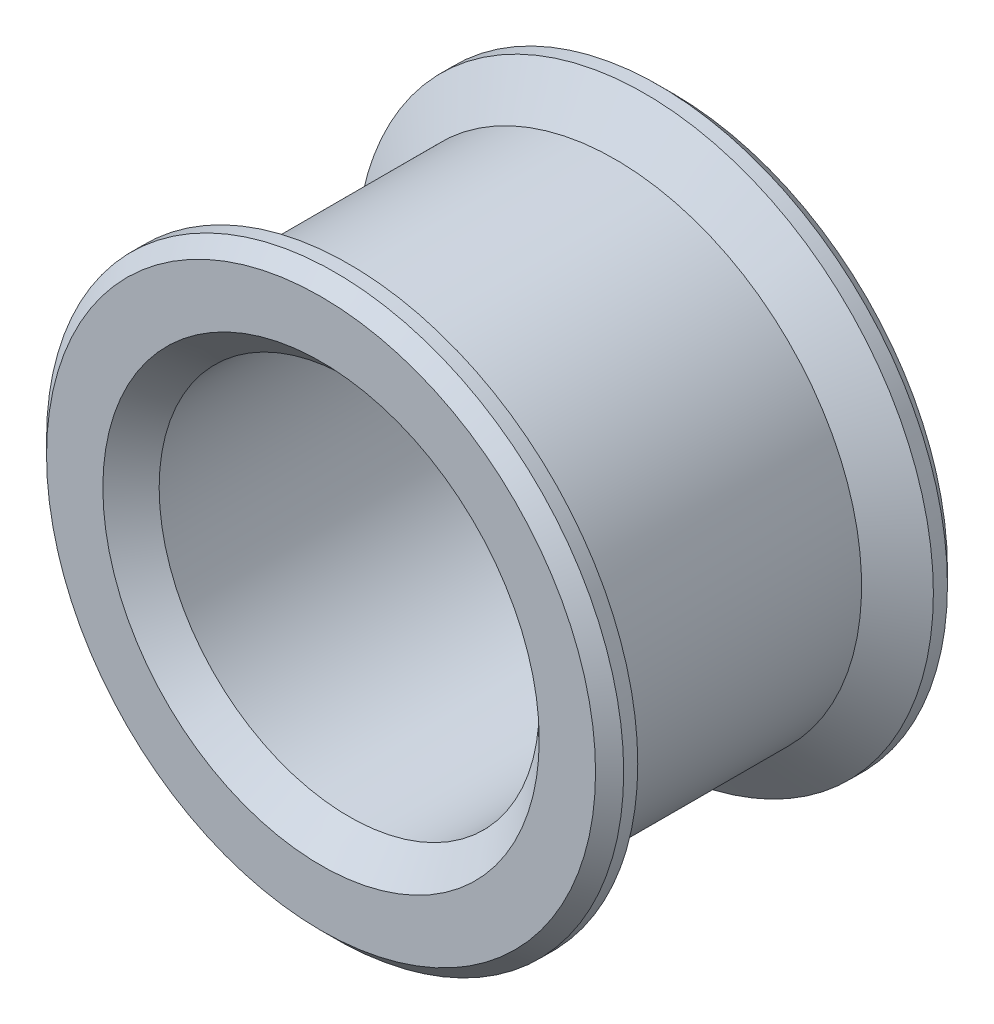
ISO-10303-21;
HEADER;
FILE_DESCRIPTION(('STEP AP214'),'2;1');
FILE_NAME('part.step','',(''),(''),'','','');
FILE_SCHEMA(('AUTOMOTIVE_DESIGN { 1 0 10303 214 1 1 1 1 }'));
ENDSEC;
DATA;
#1=APPLICATION_CONTEXT('core data for automotive mechanical design processes');
#2=APPLICATION_PROTOCOL_DEFINITION('international standard','automotive_design',2000,#1);
#3=PRODUCT_CONTEXT('',#1,'mechanical');
#4=PRODUCT('Part','Part','',(#3));
#5=PRODUCT_RELATED_PRODUCT_CATEGORY('part','',(#4));
#6=PRODUCT_DEFINITION_FORMATION('','',#4);
#7=PRODUCT_DEFINITION_CONTEXT('part definition',#1,'design');
#8=PRODUCT_DEFINITION('design','',#6,#7);
#9=PRODUCT_DEFINITION_SHAPE('','',#8);
#10=(LENGTH_UNIT() NAMED_UNIT(*) SI_UNIT(.MILLI.,.METRE.));
#11=(NAMED_UNIT(*) PLANE_ANGLE_UNIT() SI_UNIT($,.RADIAN.));
#12=(NAMED_UNIT(*) SI_UNIT($,.STERADIAN.) SOLID_ANGLE_UNIT());
#13=UNCERTAINTY_MEASURE_WITH_UNIT(LENGTH_MEASURE(1.E-05),#10,'distance_accuracy_value','');
#14=(GEOMETRIC_REPRESENTATION_CONTEXT(3) GLOBAL_UNCERTAINTY_ASSIGNED_CONTEXT((#13)) GLOBAL_UNIT_ASSIGNED_CONTEXT((#10,
#11,#12)) REPRESENTATION_CONTEXT('',''));
#15=CARTESIAN_POINT('',(0.,0.,0.));
#16=DIRECTION('',(0.,0.,1.));
#17=DIRECTION('',(1.,0.,0.));
#18=AXIS2_PLACEMENT_3D('',#15,#16,#17);
#19=CARTESIAN_POINT('',(0.,0.,5.25));
#20=DIRECTION('',(0.,0.,-1.));
#21=DIRECTION('',(-1.,0.,0.));
#22=AXIS2_PLACEMENT_3D('',#19,#20,#21);
#23=CYLINDRICAL_SURFACE('',#22,8.75);
#24=CARTESIAN_POINT('',(0.,0.,-4.19968869268542));
#25=DIRECTION('',(0.,0.,-1.));
#26=DIRECTION('',(-1.,0.,0.));
#27=AXIS2_PLACEMENT_3D('',#24,#25,#26);
#28=CIRCLE('',#27,8.75);
#29=CARTESIAN_POINT('',(-8.75,0.,-4.19968869268542));
#30=VERTEX_POINT('',#29);
#31=EDGE_CURVE('E65',#30,#30,#28,.F.);
#32=CARTESIAN_POINT('',(0.,0.,4.19968869268542));
#33=DIRECTION('',(0.,0.,1.));
#34=DIRECTION('',(1.,0.,0.));
#35=AXIS2_PLACEMENT_3D('',#32,#33,#34);
#36=CIRCLE('',#35,8.75);
#37=CARTESIAN_POINT('',(-8.75,0.,4.19968869268542));
#38=VERTEX_POINT('',#37);
#39=EDGE_CURVE('E68',#38,#38,#36,.F.);
#40=CARTESIAN_POINT('',(-8.75,0.,-4.19968869268542));
#41=CARTESIAN_POINT('',(-8.75,0.,-4.11219517825447));
#42=CARTESIAN_POINT('',(-8.75,0.,-4.02470166382353));
#43=CARTESIAN_POINT('',(-8.75,0.,-3.84971463496163));
#44=CARTESIAN_POINT('',(-8.75,0.,-3.76222112053069));
#45=CARTESIAN_POINT('',(-8.75,0.,-3.58723409166879));
#46=CARTESIAN_POINT('',(-8.75,0.,-3.49974057723785));
#47=CARTESIAN_POINT('',(-8.75,0.,-3.32475354837596));
#48=CARTESIAN_POINT('',(-8.75,0.,-3.23726003394501));
#49=CARTESIAN_POINT('',(-8.75,0.,-3.06227300508312));
#50=CARTESIAN_POINT('',(-8.75,0.,-2.97477949065217));
#51=CARTESIAN_POINT('',(-8.75,0.,-2.79979246179028));
#52=CARTESIAN_POINT('',(-8.75,0.,-2.71229894735933));
#53=CARTESIAN_POINT('',(-8.75,0.,-2.53731191849744));
#54=CARTESIAN_POINT('',(-8.75,0.,-2.44981840406649));
#55=CARTESIAN_POINT('',(-8.75,0.,-2.2748313752046));
#56=CARTESIAN_POINT('',(-8.75,0.,-2.18733786077366));
#57=CARTESIAN_POINT('',(-8.75,0.,-2.01235083191176));
#58=CARTESIAN_POINT('',(-8.75,0.,-1.92485731748082));
#59=CARTESIAN_POINT('',(-8.75,0.,-1.74987028861892));
#60=CARTESIAN_POINT('',(-8.75,0.,-1.66237677418798));
#61=CARTESIAN_POINT('',(-8.75,0.,-1.48738974532609));
#62=CARTESIAN_POINT('',(-8.75,0.,-1.39989623089514));
#63=CARTESIAN_POINT('',(-8.75,0.,-1.22490920203325));
#64=CARTESIAN_POINT('',(-8.75,0.,-1.1374156876023));
#65=CARTESIAN_POINT('',(-8.75,0.,-0.962428658740408));
#66=CARTESIAN_POINT('',(-8.75,0.,-0.874935144309462));
#67=CARTESIAN_POINT('',(-8.75,0.,-0.699948115447569));
#68=CARTESIAN_POINT('',(-8.75,0.,-0.612454601016623));
#69=CARTESIAN_POINT('',(-8.75,0.,-0.437467572154731));
#70=CARTESIAN_POINT('',(-8.75,0.,-0.349974057723784));
#71=CARTESIAN_POINT('',(-8.75,0.,-0.174987028861891));
#72=CARTESIAN_POINT('',(-8.75,0.,-0.0874935144309453));
#73=CARTESIAN_POINT('',(-8.75,0.,0.087493514430947));
#74=CARTESIAN_POINT('',(-8.75,0.,0.174987028861893));
#75=CARTESIAN_POINT('',(-8.75,0.,0.349974057723786));
#76=CARTESIAN_POINT('',(-8.75,0.,0.437467572154732));
#77=CARTESIAN_POINT('',(-8.75,0.,0.612454601016625));
#78=CARTESIAN_POINT('',(-8.75,0.,0.699948115447571));
#79=CARTESIAN_POINT('',(-8.75,0.,0.874935144309463));
#80=CARTESIAN_POINT('',(-8.75,0.,0.96242865874041));
#81=CARTESIAN_POINT('',(-8.75,0.,1.1374156876023));
#82=CARTESIAN_POINT('',(-8.75,0.,1.22490920203325));
#83=CARTESIAN_POINT('',(-8.75,0.,1.39989623089514));
#84=CARTESIAN_POINT('',(-8.75,0.,1.48738974532609));
#85=CARTESIAN_POINT('',(-8.75,0.,1.66237677418798));
#86=CARTESIAN_POINT('',(-8.75,0.,1.74987028861893));
#87=CARTESIAN_POINT('',(-8.75,0.,1.92485731748082));
#88=CARTESIAN_POINT('',(-8.75,0.,2.01235083191176));
#89=CARTESIAN_POINT('',(-8.75,0.,2.18733786077366));
#90=CARTESIAN_POINT('',(-8.75,0.,2.2748313752046));
#91=CARTESIAN_POINT('',(-8.75,0.,2.4498184040665));
#92=CARTESIAN_POINT('',(-8.75,0.,2.53731191849744));
#93=CARTESIAN_POINT('',(-8.75,0.,2.71229894735933));
#94=CARTESIAN_POINT('',(-8.75,0.,2.79979246179028));
#95=CARTESIAN_POINT('',(-8.75,0.,2.97477949065217));
#96=CARTESIAN_POINT('',(-8.75,0.,3.06227300508312));
#97=CARTESIAN_POINT('',(-8.75,0.,3.23726003394501));
#98=CARTESIAN_POINT('',(-8.75,0.,3.32475354837596));
#99=CARTESIAN_POINT('',(-8.75,0.,3.49974057723785));
#100=CARTESIAN_POINT('',(-8.75,0.,3.5872340916688));
#101=CARTESIAN_POINT('',(-8.75,0.,3.76222112053069));
#102=CARTESIAN_POINT('',(-8.75,0.,3.84971463496164));
#103=CARTESIAN_POINT('',(-8.75,0.,4.02470166382353));
#104=CARTESIAN_POINT('',(-8.75,0.,4.11219517825447));
#105=CARTESIAN_POINT('',(-8.75,0.,4.19968869268542));
#106=B_SPLINE_CURVE_WITH_KNOTS('',3,(#40,#41,#42,#43,#44,#45,#46,#47,#48,#49,#50,#51,#52,#53,
#54,#55,#56,#57,#58,#59,#60,#61,#62,#63,#64,#65,#66,#67,#68,#69,#70,#71,#72,#73,#74,#75,#76,#77,
#78,#79,#80,#81,#82,#83,#84,#85,#86,#87,#88,#89,#90,#91,#92,#93,#94,#95,#96,#97,#98,#99,#100,
#101,#102,#103,#104,#105),.UNSPECIFIED.,.F.,.F.,(4,2,2,2,2,2,2,2,2,2,2,2,2,2,2,2,2,2,2,2,2,2,2,
2,2,2,2,2,2,2,2,2,4),(0.,0.262480543292838,0.524961086585677,0.787441629878517,1.04992217317136,
1.31240271646419,1.57488325975703,1.83736380304987,2.09984434634271,2.36232488963555,
2.62480543292839,2.88728597622123,3.14976651951406,3.4122470628069,3.67472760609974,
3.93720814939258,4.19968869268542,4.46216923597826,4.7246497792711,4.98713032256394,
5.24961086585677,5.51209140914961,5.77457195244245,6.03705249573529,6.29953303902813,
6.56201358232097,6.82449412561381,7.08697466890665,7.34945521219949,7.61193575549232,
7.87441629878516,8.136896842078,8.39937738537084),.UNSPECIFIED.);
#107=EDGE_CURVE('BSEAM32',#30,#38,#106,.T.);
#108=ORIENTED_EDGE('',*,*,#31,.T.);
#109=ORIENTED_EDGE('',*,*,#39,.T.);
#110=ORIENTED_EDGE('',*,*,#107,.T.);
#111=ORIENTED_EDGE('',*,*,#107,.F.);
#112=EDGE_LOOP('',(#108,#110,#109,#111));
#113=FACE_BOUND('',#112,.T.);
#114=ADVANCED_FACE('F32',(#113),#23,.T.);
#115=CARTESIAN_POINT('',(0.,0.,5.25));
#116=DIRECTION('',(0.,0.,-1.));
#117=DIRECTION('',(-1.,0.,0.));
#118=AXIS2_PLACEMENT_3D('',#115,#116,#117);
#119=CYLINDRICAL_SURFACE('',#118,6.75);
#120=CARTESIAN_POINT('',(0.,0.,-5.25000000000001));
#121=DIRECTION('',(0.,0.,-1.));
#122=DIRECTION('',(-1.,0.,0.));
#123=AXIS2_PLACEMENT_3D('',#120,#121,#122);
#124=CIRCLE('',#123,6.75);
#125=CARTESIAN_POINT('',(-6.75,0.,-5.25000000000001));
#126=VERTEX_POINT('',#125);
#127=EDGE_CURVE('E56',#126,#126,#124,.T.);
#128=CARTESIAN_POINT('',(0.,0.,5.24999999999998));
#129=DIRECTION('',(0.,0.,1.));
#130=DIRECTION('',(1.,0.,0.));
#131=AXIS2_PLACEMENT_3D('',#128,#129,#130);
#132=CIRCLE('',#131,6.75);
#133=CARTESIAN_POINT('',(-6.75,0.,5.24999999999998));
#134=VERTEX_POINT('',#133);
#135=EDGE_CURVE('E59',#134,#134,#132,.T.);
#136=CARTESIAN_POINT('',(-6.75,0.,-5.25000000000001));
#137=CARTESIAN_POINT('',(-6.75,0.,-5.14062500000001));
#138=CARTESIAN_POINT('',(-6.75,0.,-5.03125000000001));
#139=CARTESIAN_POINT('',(-6.75,0.,-4.81250000000001));
#140=CARTESIAN_POINT('',(-6.75,0.,-4.70312500000001));
#141=CARTESIAN_POINT('',(-6.75,0.,-4.48437500000001));
#142=CARTESIAN_POINT('',(-6.75,0.,-4.37500000000001));
#143=CARTESIAN_POINT('',(-6.75,0.,-4.15625000000001));
#144=CARTESIAN_POINT('',(-6.75,0.,-4.04687500000001));
#145=CARTESIAN_POINT('',(-6.75,0.,-3.82812500000001));
#146=CARTESIAN_POINT('',(-6.75,0.,-3.71875000000001));
#147=CARTESIAN_POINT('',(-6.75,0.,-3.50000000000001));
#148=CARTESIAN_POINT('',(-6.75,0.,-3.39062500000001));
#149=CARTESIAN_POINT('',(-6.75,0.,-3.17187500000001));
#150=CARTESIAN_POINT('',(-6.75,0.,-3.06250000000001));
#151=CARTESIAN_POINT('',(-6.75,0.,-2.84375000000001));
#152=CARTESIAN_POINT('',(-6.75,0.,-2.73437500000001));
#153=CARTESIAN_POINT('',(-6.75,0.,-2.51562500000001));
#154=CARTESIAN_POINT('',(-6.75,0.,-2.40625000000001));
#155=CARTESIAN_POINT('',(-6.75,0.,-2.18750000000001));
#156=CARTESIAN_POINT('',(-6.75,0.,-2.07812500000001));
#157=CARTESIAN_POINT('',(-6.75,0.,-1.85937500000001));
#158=CARTESIAN_POINT('',(-6.75,0.,-1.75000000000001));
#159=CARTESIAN_POINT('',(-6.75,0.,-1.53125000000001));
#160=CARTESIAN_POINT('',(-6.75,0.,-1.42187500000001));
#161=CARTESIAN_POINT('',(-6.75,0.,-1.20312500000001));
#162=CARTESIAN_POINT('',(-6.75,0.,-1.09375000000001));
#163=CARTESIAN_POINT('',(-6.75,0.,-0.875000000000014));
#164=CARTESIAN_POINT('',(-6.75,0.,-0.765625000000014));
#165=CARTESIAN_POINT('',(-6.75,0.,-0.546875000000014));
#166=CARTESIAN_POINT('',(-6.75,0.,-0.437500000000014));
#167=CARTESIAN_POINT('',(-6.75,0.,-0.218750000000014));
#168=CARTESIAN_POINT('',(-6.75,0.,-0.109375000000015));
#169=CARTESIAN_POINT('',(-6.75,0.,0.109374999999985));
#170=CARTESIAN_POINT('',(-6.75,0.,0.218749999999985));
#171=CARTESIAN_POINT('',(-6.75,0.,0.437499999999985));
#172=CARTESIAN_POINT('',(-6.75,0.,0.546874999999985));
#173=CARTESIAN_POINT('',(-6.75,0.,0.765624999999985));
#174=CARTESIAN_POINT('',(-6.75,0.,0.874999999999985));
#175=CARTESIAN_POINT('',(-6.75,0.,1.09374999999998));
#176=CARTESIAN_POINT('',(-6.75,0.,1.20312499999998));
#177=CARTESIAN_POINT('',(-6.75,0.,1.42187499999998));
#178=CARTESIAN_POINT('',(-6.75,0.,1.53124999999998));
#179=CARTESIAN_POINT('',(-6.75,0.,1.74999999999998));
#180=CARTESIAN_POINT('',(-6.75,0.,1.85937499999998));
#181=CARTESIAN_POINT('',(-6.75,0.,2.07812499999998));
#182=CARTESIAN_POINT('',(-6.75,0.,2.18749999999998));
#183=CARTESIAN_POINT('',(-6.75,0.,2.40624999999998));
#184=CARTESIAN_POINT('',(-6.75,0.,2.51562499999998));
#185=CARTESIAN_POINT('',(-6.75,0.,2.73437499999998));
#186=CARTESIAN_POINT('',(-6.75,0.,2.84374999999998));
#187=CARTESIAN_POINT('',(-6.75,0.,3.06249999999998));
#188=CARTESIAN_POINT('',(-6.75,0.,3.17187499999998));
#189=CARTESIAN_POINT('',(-6.75,0.,3.39062499999998));
#190=CARTESIAN_POINT('',(-6.75,0.,3.49999999999998));
#191=CARTESIAN_POINT('',(-6.75,0.,3.71874999999998));
#192=CARTESIAN_POINT('',(-6.75,0.,3.82812499999998));
#193=CARTESIAN_POINT('',(-6.75,0.,4.04687499999998));
#194=CARTESIAN_POINT('',(-6.75,0.,4.15624999999998));
#195=CARTESIAN_POINT('',(-6.75,0.,4.37499999999998));
#196=CARTESIAN_POINT('',(-6.75,0.,4.48437499999998));
#197=CARTESIAN_POINT('',(-6.75,0.,4.70312499999998));
#198=CARTESIAN_POINT('',(-6.75,0.,4.81249999999998));
#199=CARTESIAN_POINT('',(-6.75,0.,5.03124999999998));
#200=CARTESIAN_POINT('',(-6.75,0.,5.14062499999998));
#201=CARTESIAN_POINT('',(-6.75,0.,5.24999999999998));
#202=B_SPLINE_CURVE_WITH_KNOTS('',3,(#136,#137,#138,#139,#140,#141,#142,#143,#144,#145,#146,
#147,#148,#149,#150,#151,#152,#153,#154,#155,#156,#157,#158,#159,#160,#161,#162,#163,#164,#165,
#166,#167,#168,#169,#170,#171,#172,#173,#174,#175,#176,#177,#178,#179,#180,#181,#182,#183,#184,
#185,#186,#187,#188,#189,#190,#191,#192,#193,#194,#195,#196,#197,#198,#199,#200,#201),
.UNSPECIFIED.,.F.,.F.,(4,2,2,2,2,2,2,2,2,2,2,2,2,2,2,2,2,2,2,2,2,2,2,2,2,2,2,2,2,2,2,2,4),(0.,
0.328125,0.656249999999999,0.984374999999999,1.3125,1.640625,1.96875,2.296875,2.625,2.953125,
3.28125,3.609375,3.9375,4.265625,4.59375,4.921875,5.25,5.578125,5.90625,6.234375,6.5625,
6.89062499999999,7.21874999999999,7.54687499999999,7.87499999999999,8.20312499999999,
8.53124999999999,8.85937499999999,9.18749999999999,9.51562499999999,9.84374999999999,10.171875,
10.5),.UNSPECIFIED.);
#203=EDGE_CURVE('BSEAM97',#126,#134,#202,.T.);
#204=ORIENTED_EDGE('',*,*,#127,.T.);
#205=ORIENTED_EDGE('',*,*,#135,.T.);
#206=ORIENTED_EDGE('',*,*,#203,.T.);
#207=ORIENTED_EDGE('',*,*,#203,.F.);
#208=EDGE_LOOP('',(#204,#206,#205,#207));
#209=FACE_BOUND('',#208,.T.);
#210=ADVANCED_FACE('F97',(#209),#119,.F.);
#211=CARTESIAN_POINT('',(0.,0.,6.25));
#212=DIRECTION('',(0.,0.,1.));
#213=DIRECTION('',(1.,0.,0.));
#214=AXIS2_PLACEMENT_3D('',#211,#212,#213);
#215=PLANE('',#214);
#216=CARTESIAN_POINT('',(0.,0.,6.25));
#217=DIRECTION('',(0.,0.,1.));
#218=DIRECTION('',(1.,0.,0.));
#219=AXIS2_PLACEMENT_3D('',#216,#217,#218);
#220=CIRCLE('',#219,9.75000000000001);
#221=CARTESIAN_POINT('',(9.75000000000001,0.,6.25));
#222=VERTEX_POINT('',#221);
#223=EDGE_CURVE('E40',#222,#222,#220,.T.);
#224=ORIENTED_EDGE('',*,*,#223,.T.);
#225=EDGE_LOOP('',(#224));
#226=FACE_BOUND('',#225,.T.);
#227=CARTESIAN_POINT('',(0.,0.,6.25));
#228=DIRECTION('',(0.,0.,1.));
#229=DIRECTION('',(1.,0.,0.));
#230=AXIS2_PLACEMENT_3D('',#227,#228,#229);
#231=CIRCLE('',#230,7.75000000000002);
#232=CARTESIAN_POINT('',(7.75000000000002,0.,6.25));
#233=VERTEX_POINT('',#232);
#234=EDGE_CURVE('E53',#233,#233,#231,.F.);
#235=ORIENTED_EDGE('',*,*,#234,.T.);
#236=EDGE_LOOP('',(#235));
#237=FACE_BOUND('',#236,.T.);
#238=ADVANCED_FACE('F93',(#226,#237),#215,.T.);
#239=CARTESIAN_POINT('',(0.,0.,6.25));
#240=DIRECTION('',(0.,0.,-1.));
#241=DIRECTION('',(-1.,0.,0.));
#242=AXIS2_PLACEMENT_3D('',#239,#240,#241);
#243=CYLINDRICAL_SURFACE('',#242,10.25);
#244=CARTESIAN_POINT('',(0.,0.,5.75000000000001));
#245=DIRECTION('',(0.,0.,1.));
#246=DIRECTION('',(1.,0.,0.));
#247=AXIS2_PLACEMENT_3D('',#244,#245,#246);
#248=CIRCLE('',#247,10.25);
#249=CARTESIAN_POINT('',(10.25,0.,5.75000000000001));
#250=VERTEX_POINT('',#249);
#251=EDGE_CURVE('E10',#250,#250,#248,.F.);
#252=ORIENTED_EDGE('',*,*,#251,.T.);
#253=EDGE_LOOP('',(#252));
#254=FACE_BOUND('',#253,.T.);
#255=CARTESIAN_POINT('',(0.,0.,5.25));
#256=DIRECTION('',(0.,0.,1.));
#257=DIRECTION('',(1.,0.,0.));
#258=AXIS2_PLACEMENT_3D('',#255,#256,#257);
#259=CIRCLE('',#258,10.25);
#260=CARTESIAN_POINT('',(10.25,0.,5.25));
#261=VERTEX_POINT('',#260);
#262=EDGE_CURVE('E71',#261,#261,#259,.T.);
#263=ORIENTED_EDGE('',*,*,#262,.T.);
#264=EDGE_LOOP('',(#263));
#265=FACE_BOUND('',#264,.T.);
#266=ADVANCED_FACE('F84',(#254,#265),#243,.T.);
#267=CARTESIAN_POINT('',(0.,0.,-6.25));
#268=DIRECTION('',(0.,0.,1.));
#269=DIRECTION('',(1.,0.,0.));
#270=AXIS2_PLACEMENT_3D('',#267,#268,#269);
#271=CYLINDRICAL_SURFACE('',#270,10.25);
#272=CARTESIAN_POINT('',(0.,0.,-5.75));
#273=DIRECTION('',(0.,0.,-1.));
#274=DIRECTION('',(-1.,0.,0.));
#275=AXIS2_PLACEMENT_3D('',#272,#273,#274);
#276=CIRCLE('',#275,10.25);
#277=CARTESIAN_POINT('',(-10.25,0.,-5.75));
#278=VERTEX_POINT('',#277);
#279=EDGE_CURVE('E48',#278,#278,#276,.F.);
#280=ORIENTED_EDGE('',*,*,#279,.T.);
#281=EDGE_LOOP('',(#280));
#282=FACE_BOUND('',#281,.T.);
#283=CARTESIAN_POINT('',(0.,0.,-5.25));
#284=DIRECTION('',(0.,0.,1.));
#285=DIRECTION('',(1.,0.,0.));
#286=AXIS2_PLACEMENT_3D('',#283,#284,#285);
#287=CIRCLE('',#286,10.25);
#288=CARTESIAN_POINT('',(10.25,0.,-5.25));
#289=VERTEX_POINT('',#288);
#290=EDGE_CURVE('E74',#289,#289,#287,.T.);
#291=ORIENTED_EDGE('',*,*,#290,.F.);
#292=EDGE_LOOP('',(#291));
#293=FACE_BOUND('',#292,.T.);
#294=ADVANCED_FACE('F81',(#282,#293),#271,.T.);
#295=CARTESIAN_POINT('',(0.,0.,-6.25));
#296=DIRECTION('',(0.,0.,-1.));
#297=DIRECTION('',(1.,0.,0.));
#298=AXIS2_PLACEMENT_3D('',#295,#296,#297);
#299=PLANE('',#298);
#300=CARTESIAN_POINT('',(0.,0.,-6.25));
#301=DIRECTION('',(0.,0.,-1.));
#302=DIRECTION('',(-1.,0.,0.));
#303=AXIS2_PLACEMENT_3D('',#300,#301,#302);
#304=CIRCLE('',#303,9.75);
#305=CARTESIAN_POINT('',(-9.75,0.,-6.25));
#306=VERTEX_POINT('',#305);
#307=EDGE_CURVE('E44',#306,#306,#304,.T.);
#308=ORIENTED_EDGE('',*,*,#307,.T.);
#309=EDGE_LOOP('',(#308));
#310=FACE_BOUND('',#309,.T.);
#311=CARTESIAN_POINT('',(0.,0.,-6.25));
#312=DIRECTION('',(0.,0.,-1.));
#313=DIRECTION('',(-1.,0.,0.));
#314=AXIS2_PLACEMENT_3D('',#311,#312,#313);
#315=CIRCLE('',#314,7.74999999999998);
#316=CARTESIAN_POINT('',(-7.74999999999998,0.,-6.25));
#317=VERTEX_POINT('',#316);
#318=EDGE_CURVE('E62',#317,#317,#315,.F.);
#319=ORIENTED_EDGE('',*,*,#318,.T.);
#320=EDGE_LOOP('',(#319));
#321=FACE_BOUND('',#320,.T.);
#322=ADVANCED_FACE('F83',(#310,#321),#299,.T.);
#323=CARTESIAN_POINT('',(0.,0.,-4.19968869268542));
#324=DIRECTION('',(0.,0.,-1.));
#325=DIRECTION('',(-1.,0.,0.));
#326=AXIS2_PLACEMENT_3D('',#323,#324,#325);
#327=CONICAL_SURFACE('',#326,8.75,0.959931088596876);
#328=ORIENTED_EDGE('',*,*,#290,.T.);
#329=EDGE_LOOP('',(#328));
#330=FACE_BOUND('',#329,.T.);
#331=ORIENTED_EDGE('',*,*,#31,.F.);
#332=EDGE_LOOP('',(#331));
#333=FACE_BOUND('',#332,.T.);
#334=ADVANCED_FACE('F78',(#330,#333),#327,.T.);
#335=CARTESIAN_POINT('',(0.,0.,5.25));
#336=DIRECTION('',(0.,0.,1.));
#337=DIRECTION('',(1.,0.,0.));
#338=AXIS2_PLACEMENT_3D('',#335,#336,#337);
#339=CONICAL_SURFACE('',#338,10.25,0.959931088596876);
#340=ORIENTED_EDGE('',*,*,#39,.F.);
#341=EDGE_LOOP('',(#340));
#342=FACE_BOUND('',#341,.T.);
#343=ORIENTED_EDGE('',*,*,#262,.F.);
#344=EDGE_LOOP('',(#343));
#345=FACE_BOUND('',#344,.T.);
#346=ADVANCED_FACE('F113',(#342,#345),#339,.T.);
#347=CARTESIAN_POINT('',(0.,0.,-6.25));
#348=DIRECTION('',(0.,0.,-1.));
#349=DIRECTION('',(-1.,0.,0.));
#350=AXIS2_PLACEMENT_3D('',#347,#348,#349);
#351=CONICAL_SURFACE('',#350,7.74999999999998,0.785398163397445);
#352=ORIENTED_EDGE('',*,*,#127,.F.);
#353=EDGE_LOOP('',(#352));
#354=FACE_BOUND('',#353,.T.);
#355=ORIENTED_EDGE('',*,*,#318,.F.);
#356=EDGE_LOOP('',(#355));
#357=FACE_BOUND('',#356,.T.);
#358=ADVANCED_FACE('F119',(#354,#357),#351,.F.);
#359=CARTESIAN_POINT('',(0.,0.,5.24999999999998));
#360=DIRECTION('',(0.,0.,1.));
#361=DIRECTION('',(1.,0.,0.));
#362=AXIS2_PLACEMENT_3D('',#359,#360,#361);
#363=CONICAL_SURFACE('',#362,6.75,0.78539816339745);
#364=ORIENTED_EDGE('',*,*,#234,.F.);
#365=EDGE_LOOP('',(#364));
#366=FACE_BOUND('',#365,.T.);
#367=ORIENTED_EDGE('',*,*,#135,.F.);
#368=EDGE_LOOP('',(#367));
#369=FACE_BOUND('',#368,.T.);
#370=ADVANCED_FACE('F126',(#366,#369),#363,.F.);
#371=CARTESIAN_POINT('',(0.,0.,-5.75));
#372=DIRECTION('',(0.,0.,1.));
#373=DIRECTION('',(1.,0.,0.));
#374=AXIS2_PLACEMENT_3D('',#371,#372,#373);
#375=CONICAL_SURFACE('',#374,10.25,0.785398163397452);
#376=ORIENTED_EDGE('',*,*,#307,.F.);
#377=EDGE_LOOP('',(#376));
#378=FACE_BOUND('',#377,.T.);
#379=ORIENTED_EDGE('',*,*,#279,.F.);
#380=EDGE_LOOP('',(#379));
#381=FACE_BOUND('',#380,.T.);
#382=ADVANCED_FACE('F132',(#378,#381),#375,.T.);
#383=CARTESIAN_POINT('',(0.,0.,6.25));
#384=DIRECTION('',(0.,0.,-1.));
#385=DIRECTION('',(-1.,0.,0.));
#386=AXIS2_PLACEMENT_3D('',#383,#384,#385);
#387=CONICAL_SURFACE('',#386,9.75000000000001,0.785398163397448);
#388=ORIENTED_EDGE('',*,*,#251,.F.);
#389=EDGE_LOOP('',(#388));
#390=FACE_BOUND('',#389,.T.);
#391=ORIENTED_EDGE('',*,*,#223,.F.);
#392=EDGE_LOOP('',(#391));
#393=FACE_BOUND('',#392,.T.);
#394=ADVANCED_FACE('F35',(#390,#393),#387,.T.);
#395=CLOSED_SHELL('',(#114,#210,#238,#266,#294,#322,#334,#346,#358,#370,#382,#394));
#396=MANIFOLD_SOLID_BREP('B2',#395);
#397=ADVANCED_BREP_SHAPE_REPRESENTATION('',(#18,#396),#14);
#398=SHAPE_DEFINITION_REPRESENTATION(#9,#397);
ENDSEC;
END-ISO-10303-21;
